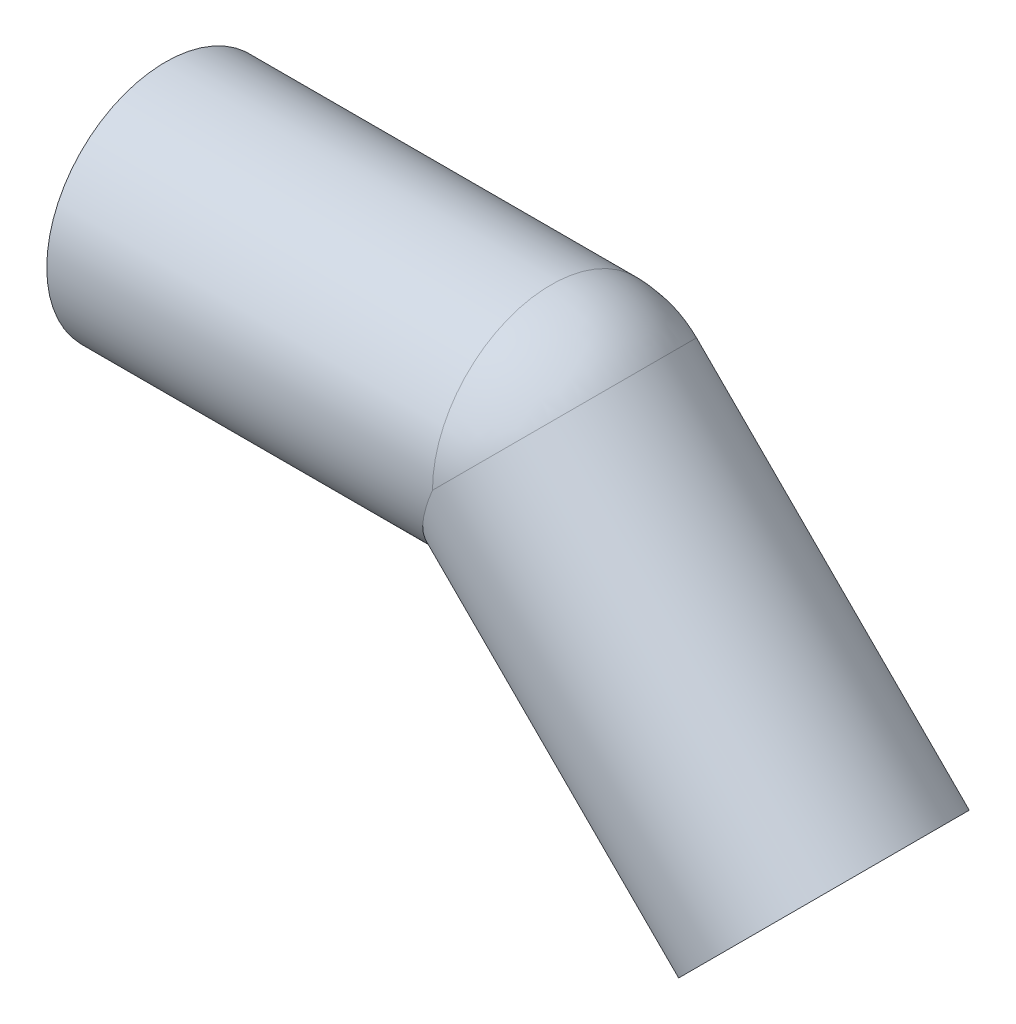
ISO-10303-21;
HEADER;
FILE_DESCRIPTION(('STEP AP214'),'2;1');
FILE_NAME('part.step','',(''),(''),'','','');
FILE_SCHEMA(('AUTOMOTIVE_DESIGN { 1 0 10303 214 1 1 1 1 }'));
ENDSEC;
DATA;
#1=APPLICATION_CONTEXT('core data for automotive mechanical design processes');
#2=APPLICATION_PROTOCOL_DEFINITION('international standard','automotive_design',2000,#1);
#3=PRODUCT_CONTEXT('',#1,'mechanical');
#4=PRODUCT('Part','Part','',(#3));
#5=PRODUCT_RELATED_PRODUCT_CATEGORY('part','',(#4));
#6=PRODUCT_DEFINITION_FORMATION('','',#4);
#7=PRODUCT_DEFINITION_CONTEXT('part definition',#1,'design');
#8=PRODUCT_DEFINITION('design','',#6,#7);
#9=PRODUCT_DEFINITION_SHAPE('','',#8);
#10=(LENGTH_UNIT() NAMED_UNIT(*) SI_UNIT(.MILLI.,.METRE.));
#11=(NAMED_UNIT(*) PLANE_ANGLE_UNIT() SI_UNIT($,.RADIAN.));
#12=(NAMED_UNIT(*) SI_UNIT($,.STERADIAN.) SOLID_ANGLE_UNIT());
#13=UNCERTAINTY_MEASURE_WITH_UNIT(LENGTH_MEASURE(1.E-05),#10,'distance_accuracy_value','');
#14=(GEOMETRIC_REPRESENTATION_CONTEXT(3) GLOBAL_UNCERTAINTY_ASSIGNED_CONTEXT((#13)) GLOBAL_UNIT_ASSIGNED_CONTEXT((#10,
#11,#12)) REPRESENTATION_CONTEXT('',''));
#15=CARTESIAN_POINT('',(0.,0.,0.));
#16=DIRECTION('',(0.,0.,1.));
#17=DIRECTION('',(1.,0.,0.));
#18=AXIS2_PLACEMENT_3D('',#15,#16,#17);
#19=CARTESIAN_POINT('',(88.7695526217002,-36.7695526217012,0.));
#20=DIRECTION('',(-0.707106781186531,0.707106781186564,0.));
#21=DIRECTION('',(-0.707106781186564,-0.707106781186531,0.));
#22=AXIS2_PLACEMENT_3D('',#19,#20,#21);
#23=CYLINDRICAL_SURFACE('',#22,13.6);
#24=CARTESIAN_POINT('',(52.,0.,0.));
#25=DIRECTION('',(0.707106781186547,-0.707106781186548,0.));
#26=DIRECTION('',(0.,0.,-1.));
#27=AXIS2_PLACEMENT_3D('',#24,#25,#26);
#28=CIRCLE('',#27,13.6);
#29=CARTESIAN_POINT('',(61.6166522244259,9.61665222384815,0.));
#30=VERTEX_POINT('',#29);
#31=CARTESIAN_POINT('',(52.0000000000007,-2.89352133305626E-13,13.6));
#32=VERTEX_POINT('',#31);
#33=EDGE_CURVE('E53',#30,#32,#28,.T.);
#34=ORIENTED_EDGE('',*,*,#33,.F.);
#35=CARTESIAN_POINT('',(52.,0.,0.));
#36=DIRECTION('',(0.707106781122822,-0.707106781250273,0.));
#37=DIRECTION('',(0.,0.,-1.));
#38=AXIS2_PLACEMENT_3D('',#35,#36,#37);
#39=CIRCLE('',#38,13.6);
#40=CARTESIAN_POINT('',(52.0000000000007,-2.79811478516556E-13,-13.6));
#41=VERTEX_POINT('',#40);
#42=EDGE_CURVE('E46',#41,#30,#39,.T.);
#43=ORIENTED_EDGE('',*,*,#42,.F.);
#44=CARTESIAN_POINT('',(52.0000000000008,0.,0.));
#45=DIRECTION('',(-0.923879532511282,0.382683432365101,0.));
#46=DIRECTION('',(-0.382683432365101,-0.923879532511282,0.));
#47=AXIS2_PLACEMENT_3D('',#44,#45,#46);
#48=ELLIPSE('',#47,14.7205339239766,13.6);
#49=EDGE_CURVE('E55',#32,#41,#48,.F.);
#50=ORIENTED_EDGE('',*,*,#49,.F.);
#51=EDGE_LOOP('',(#34,#43,#50));
#52=FACE_BOUND('',#51,.T.);
#53=CARTESIAN_POINT('',(88.7695526216998,-36.7695526217007,0.));
#54=DIRECTION('',(-0.70710678118653,0.707106781186565,0.));
#55=DIRECTION('',(-0.707106781186565,-0.70710678118653,0.));
#56=AXIS2_PLACEMENT_3D('',#53,#54,#55);
#57=CIRCLE('',#56,13.6);
#58=CARTESIAN_POINT('',(79.1529003975624,-46.3862048458376,0.));
#59=VERTEX_POINT('',#58);
#60=EDGE_CURVE('E18',#59,#59,#57,.T.);
#61=ORIENTED_EDGE('',*,*,#60,.F.);
#62=EDGE_LOOP('',(#61));
#63=FACE_BOUND('',#62,.T.);
#64=ADVANCED_FACE('F15',(#52,#63),#23,.F.);
#65=CARTESIAN_POINT('',(52.,0.,0.));
#66=DIRECTION('',(0.,0.,1.));
#67=DIRECTION('',(-1.,0.,0.));
#68=AXIS2_PLACEMENT_3D('',#65,#66,#67);
#69=SPHERICAL_SURFACE('',#68,13.6);
#70=CARTESIAN_POINT('',(52.,0.,0.));
#71=DIRECTION('',(-1.,0.,0.));
#72=DIRECTION('',(0.,1.,0.));
#73=AXIS2_PLACEMENT_3D('',#70,#71,#72);
#74=CIRCLE('',#73,13.6);
#75=EDGE_CURVE('E51',#41,#32,#74,.F.);
#76=ORIENTED_EDGE('',*,*,#75,.F.);
#77=ORIENTED_EDGE('',*,*,#42,.T.);
#78=ORIENTED_EDGE('',*,*,#33,.T.);
#79=EDGE_LOOP('',(#76,#77,#78));
#80=FACE_BOUND('',#79,.T.);
#81=ADVANCED_FACE('F58',(#80),#69,.F.);
#82=CARTESIAN_POINT('',(100.083261120685,-25.4558441227157,16.1920021082981));
#83=DIRECTION('',(0.707106781186547,-0.707106781186548,0.));
#84=DIRECTION('',(-0.707106781186548,-0.707106781186547,0.));
#85=AXIS2_PLACEMENT_3D('',#82,#83,#84);
#86=PLANE('',#85);
#87=ORIENTED_EDGE('',*,*,#60,.T.);
#88=EDGE_LOOP('',(#87));
#89=FACE_BOUND('',#88,.T.);
#90=CARTESIAN_POINT('',(88.7695526216997,-36.7695526217007,0.));
#91=DIRECTION('',(-0.70710678118653,0.707106781186565,0.));
#92=DIRECTION('',(-0.707106781186565,-0.70710678118653,0.));
#93=AXIS2_PLACEMENT_3D('',#90,#91,#92);
#94=CIRCLE('',#93,16.);
#95=CARTESIAN_POINT('',(77.4558441227147,-48.0832611206852,0.));
#96=VERTEX_POINT('',#95);
#97=EDGE_CURVE('E71',#96,#96,#94,.T.);
#98=ORIENTED_EDGE('',*,*,#97,.F.);
#99=EDGE_LOOP('',(#98));
#100=FACE_BOUND('',#99,.T.);
#101=ADVANCED_FACE('F80',(#89,#100),#86,.T.);
#102=CARTESIAN_POINT('',(52.,0.,0.));
#103=DIRECTION('',(-1.,0.,0.));
#104=DIRECTION('',(0.,0.,1.));
#105=AXIS2_PLACEMENT_3D('',#102,#103,#104);
#106=CYLINDRICAL_SURFACE('',#105,13.6);
#107=CARTESIAN_POINT('',(0.,0.,0.));
#108=DIRECTION('',(-1.,0.,0.));
#109=DIRECTION('',(0.,0.,1.));
#110=AXIS2_PLACEMENT_3D('',#107,#108,#109);
#111=CIRCLE('',#110,13.6);
#112=CARTESIAN_POINT('',(0.,0.,13.6));
#113=VERTEX_POINT('',#112);
#114=EDGE_CURVE('E68',#113,#113,#111,.F.);
#115=ORIENTED_EDGE('',*,*,#114,.F.);
#116=EDGE_LOOP('',(#115));
#117=FACE_BOUND('',#116,.T.);
#118=ORIENTED_EDGE('',*,*,#49,.T.);
#119=ORIENTED_EDGE('',*,*,#75,.T.);
#120=EDGE_LOOP('',(#118,#119));
#121=FACE_BOUND('',#120,.T.);
#122=ADVANCED_FACE('F83',(#117,#121),#106,.F.);
#123=CARTESIAN_POINT('',(52.,0.,0.));
#124=DIRECTION('',(0.,0.,1.));
#125=DIRECTION('',(1.,0.,0.));
#126=AXIS2_PLACEMENT_3D('',#123,#124,#125);
#127=SPHERICAL_SURFACE('',#126,16.);
#128=CARTESIAN_POINT('',(52.,0.,0.));
#129=DIRECTION('',(-1.,0.,0.));
#130=DIRECTION('',(0.,1.,0.));
#131=AXIS2_PLACEMENT_3D('',#128,#129,#130);
#132=CIRCLE('',#131,16.);
#133=CARTESIAN_POINT('',(52.0000000000007,-3.26194231330408E-13,16.));
#134=VERTEX_POINT('',#133);
#135=CARTESIAN_POINT('',(52.0000000000007,-3.33926333016187E-13,-15.9999999999999));
#136=VERTEX_POINT('',#135);
#137=EDGE_CURVE('E67',#134,#136,#132,.T.);
#138=ORIENTED_EDGE('',*,*,#137,.F.);
#139=CARTESIAN_POINT('',(52.,0.,0.));
#140=DIRECTION('',(-0.707106781229083,0.707106781144012,0.));
#141=DIRECTION('',(0.,0.,1.));
#142=AXIS2_PLACEMENT_3D('',#139,#140,#141);
#143=CIRCLE('',#142,16.);
#144=CARTESIAN_POINT('',(63.3137084986446,11.3137084993249,0.));
#145=VERTEX_POINT('',#144);
#146=EDGE_CURVE('E73',#134,#145,#143,.T.);
#147=ORIENTED_EDGE('',*,*,#146,.T.);
#148=CARTESIAN_POINT('',(52.0000000000004,4.16333634234434E-13,0.));
#149=DIRECTION('',(-0.70710678118653,0.707106781186565,0.));
#150=DIRECTION('',(0.707106781186565,0.70710678118653,0.));
#151=AXIS2_PLACEMENT_3D('',#148,#149,#150);
#152=CIRCLE('',#151,15.9999999999994);
#153=EDGE_CURVE('E33',#136,#145,#152,.F.);
#154=ORIENTED_EDGE('',*,*,#153,.F.);
#155=EDGE_LOOP('',(#138,#147,#154));
#156=FACE_BOUND('',#155,.T.);
#157=ADVANCED_FACE('F87',(#156),#127,.T.);
#158=CARTESIAN_POINT('',(52.0000000000004,4.28476698566271E-13,0.));
#159=DIRECTION('',(-0.70710678118653,0.707106781186565,0.));
#160=DIRECTION('',(-0.707106781186565,-0.70710678118653,0.));
#161=AXIS2_PLACEMENT_3D('',#158,#159,#160);
#162=CYLINDRICAL_SURFACE('',#161,16.);
#163=ORIENTED_EDGE('',*,*,#97,.T.);
#164=EDGE_LOOP('',(#163));
#165=FACE_BOUND('',#164,.T.);
#166=CARTESIAN_POINT('',(52.0000000000009,0.,0.));
#167=DIRECTION('',(-0.923879532511282,0.382683432365101,0.));
#168=DIRECTION('',(-0.382683432365101,-0.923879532511282,0.));
#169=AXIS2_PLACEMENT_3D('',#166,#167,#168);
#170=ELLIPSE('',#169,17.3182752046784,16.);
#171=EDGE_CURVE('E24',#136,#134,#170,.T.);
#172=ORIENTED_EDGE('',*,*,#171,.F.);
#173=ORIENTED_EDGE('',*,*,#153,.T.);
#174=ORIENTED_EDGE('',*,*,#146,.F.);
#175=EDGE_LOOP('',(#172,#173,#174));
#176=FACE_BOUND('',#175,.T.);
#177=ADVANCED_FACE('F91',(#165,#176),#162,.T.);
#178=CARTESIAN_POINT('',(0.,-16.,16.1920021084034));
#179=DIRECTION('',(-1.,0.,0.));
#180=DIRECTION('',(0.,1.,0.));
#181=AXIS2_PLACEMENT_3D('',#178,#179,#180);
#182=PLANE('',#181);
#183=ORIENTED_EDGE('',*,*,#114,.T.);
#184=EDGE_LOOP('',(#183));
#185=FACE_BOUND('',#184,.T.);
#186=CARTESIAN_POINT('',(0.,0.,0.));
#187=DIRECTION('',(-1.,0.,0.));
#188=DIRECTION('',(0.,0.,1.));
#189=AXIS2_PLACEMENT_3D('',#186,#187,#188);
#190=CIRCLE('',#189,16.);
#191=CARTESIAN_POINT('',(0.,0.,16.));
#192=VERTEX_POINT('',#191);
#193=EDGE_CURVE('E9',#192,#192,#190,.F.);
#194=ORIENTED_EDGE('',*,*,#193,.F.);
#195=EDGE_LOOP('',(#194));
#196=FACE_BOUND('',#195,.T.);
#197=ADVANCED_FACE('F105',(#185,#196),#182,.T.);
#198=CARTESIAN_POINT('',(0.,0.,0.));
#199=DIRECTION('',(-1.,0.,0.));
#200=DIRECTION('',(0.,0.,1.));
#201=AXIS2_PLACEMENT_3D('',#198,#199,#200);
#202=CYLINDRICAL_SURFACE('',#201,16.);
#203=ORIENTED_EDGE('',*,*,#171,.T.);
#204=ORIENTED_EDGE('',*,*,#137,.T.);
#205=EDGE_LOOP('',(#203,#204));
#206=FACE_BOUND('',#205,.T.);
#207=ORIENTED_EDGE('',*,*,#193,.T.);
#208=EDGE_LOOP('',(#207));
#209=FACE_BOUND('',#208,.T.);
#210=ADVANCED_FACE('F102',(#206,#209),#202,.T.);
#211=CLOSED_SHELL('',(#64,#81,#101,#122,#157,#177,#197,#210));
#212=MANIFOLD_SOLID_BREP('B1',#211);
#213=ADVANCED_BREP_SHAPE_REPRESENTATION('',(#18,#212),#14);
#214=SHAPE_DEFINITION_REPRESENTATION(#9,#213);
ENDSEC;
END-ISO-10303-21;
